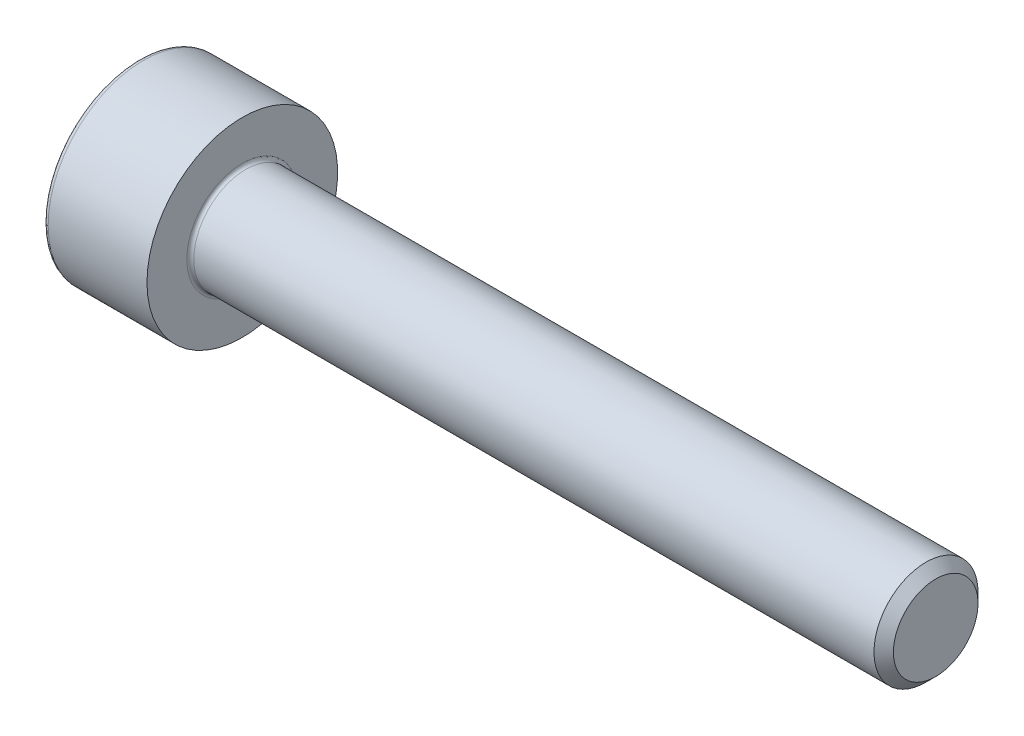
ISO-10303-21;
HEADER;
FILE_DESCRIPTION(('STEP AP214'),'2;1');
FILE_NAME('part.step','',(''),(''),'','','');
FILE_SCHEMA(('AUTOMOTIVE_DESIGN { 1 0 10303 214 1 1 1 1 }'));
ENDSEC;
DATA;
#1=APPLICATION_CONTEXT('core data for automotive mechanical design processes');
#2=APPLICATION_PROTOCOL_DEFINITION('international standard','automotive_design',2000,#1);
#3=PRODUCT_CONTEXT('',#1,'mechanical');
#4=PRODUCT('Part','Part','',(#3));
#5=PRODUCT_RELATED_PRODUCT_CATEGORY('part','',(#4));
#6=PRODUCT_DEFINITION_FORMATION('','',#4);
#7=PRODUCT_DEFINITION_CONTEXT('part definition',#1,'design');
#8=PRODUCT_DEFINITION('design','',#6,#7);
#9=PRODUCT_DEFINITION_SHAPE('','',#8);
#10=(LENGTH_UNIT() NAMED_UNIT(*) SI_UNIT(.MILLI.,.METRE.));
#11=(NAMED_UNIT(*) PLANE_ANGLE_UNIT() SI_UNIT($,.RADIAN.));
#12=(NAMED_UNIT(*) SI_UNIT($,.STERADIAN.) SOLID_ANGLE_UNIT());
#13=UNCERTAINTY_MEASURE_WITH_UNIT(LENGTH_MEASURE(1.E-05),#10,'distance_accuracy_value','');
#14=(GEOMETRIC_REPRESENTATION_CONTEXT(3) GLOBAL_UNCERTAINTY_ASSIGNED_CONTEXT((#13)) GLOBAL_UNIT_ASSIGNED_CONTEXT((#10,
#11,#12)) REPRESENTATION_CONTEXT('',''));
#15=CARTESIAN_POINT('',(0.,0.,0.));
#16=DIRECTION('',(0.,0.,1.));
#17=DIRECTION('',(1.,0.,0.));
#18=AXIS2_PLACEMENT_3D('',#15,#16,#17);
#19=CARTESIAN_POINT('',(0.,0.,0.));
#20=DIRECTION('',(-1.,0.,0.));
#21=DIRECTION('',(0.,0.,1.));
#22=AXIS2_PLACEMENT_3D('',#19,#20,#21);
#23=PLANE('',#22);
#24=DIRECTION('',(0.,-0.499999999999999,0.866025403784439));
#25=VECTOR('',#24,1.);
#26=CARTESIAN_POINT('',(0.,1.47801668912544,0.));
#27=LINE('',#26,#25);
#28=CARTESIAN_POINT('',(0.,1.47801668912544,0.));
#29=VERTEX_POINT('',#28);
#30=CARTESIAN_POINT('',(0.,0.73900834456272,1.28));
#31=VERTEX_POINT('',#30);
#32=EDGE_CURVE('E259',#29,#31,#27,.T.);
#33=ORIENTED_EDGE('',*,*,#32,.T.);
#34=DIRECTION('',(0.,1.,0.));
#35=VECTOR('',#34,1.);
#36=CARTESIAN_POINT('',(0.,-0.739008344562723,1.28));
#37=LINE('',#36,#35);
#38=CARTESIAN_POINT('',(0.,-0.739008344562723,1.28));
#39=VERTEX_POINT('',#38);
#40=EDGE_CURVE('E131',#39,#31,#37,.T.);
#41=ORIENTED_EDGE('',*,*,#40,.F.);
#42=DIRECTION('',(0.,-0.500000000000001,-0.866025403784438));
#43=VECTOR('',#42,1.);
#44=CARTESIAN_POINT('',(0.,-0.739008344562723,1.28));
#45=LINE('',#44,#43);
#46=CARTESIAN_POINT('',(0.,-1.47801668912545,0.));
#47=VERTEX_POINT('',#46);
#48=EDGE_CURVE('E262',#39,#47,#45,.T.);
#49=ORIENTED_EDGE('',*,*,#48,.T.);
#50=DIRECTION('',(0.,0.499999999999999,-0.866025403784439));
#51=VECTOR('',#50,1.);
#52=CARTESIAN_POINT('',(0.,-1.47801668912545,0.));
#53=LINE('',#52,#51);
#54=CARTESIAN_POINT('',(0.,-0.739008344562727,-1.28));
#55=VERTEX_POINT('',#54);
#56=EDGE_CURVE('E265',#47,#55,#53,.T.);
#57=ORIENTED_EDGE('',*,*,#56,.T.);
#58=DIRECTION('',(0.,-1.,0.));
#59=VECTOR('',#58,1.);
#60=CARTESIAN_POINT('',(0.,0.739008344562717,-1.28));
#61=LINE('',#60,#59);
#62=CARTESIAN_POINT('',(0.,0.739008344562717,-1.28));
#63=VERTEX_POINT('',#62);
#64=EDGE_CURVE('E268',#63,#55,#61,.T.);
#65=ORIENTED_EDGE('',*,*,#64,.F.);
#66=DIRECTION('',(0.,-0.500000000000001,-0.866025403784438));
#67=VECTOR('',#66,1.);
#68=CARTESIAN_POINT('',(0.,1.47801668912544,0.));
#69=LINE('',#68,#67);
#70=EDGE_CURVE('E126',#29,#63,#69,.T.);
#71=ORIENTED_EDGE('',*,*,#70,.F.);
#72=EDGE_LOOP('',(#33,#41,#49,#57,#65,#71));
#73=FACE_BOUND('',#72,.T.);
#74=CARTESIAN_POINT('',(0.,0.,0.));
#75=DIRECTION('',(-1.,0.,0.));
#76=DIRECTION('',(0.,0.,1.));
#77=AXIS2_PLACEMENT_3D('',#74,#75,#76);
#78=CIRCLE('',#77,2.6);
#79=CARTESIAN_POINT('',(0.,0.,2.6));
#80=VERTEX_POINT('',#79);
#81=EDGE_CURVE('E43',#80,#80,#78,.T.);
#82=ORIENTED_EDGE('',*,*,#81,.T.);
#83=EDGE_LOOP('',(#82));
#84=FACE_BOUND('',#83,.T.);
#85=ADVANCED_FACE('F35',(#73,#84),#23,.T.);
#86=CARTESIAN_POINT('',(-31.75,0.,0.));
#87=DIRECTION('',(-1.,0.,0.));
#88=DIRECTION('',(0.,0.,1.));
#89=AXIS2_PLACEMENT_3D('',#86,#87,#88);
#90=CYLINDRICAL_SURFACE('',#89,2.75);
#91=CARTESIAN_POINT('',(0.149999999999997,0.,0.));
#92=DIRECTION('',(-1.,0.,0.));
#93=DIRECTION('',(0.,0.,1.));
#94=AXIS2_PLACEMENT_3D('',#91,#92,#93);
#95=CIRCLE('',#94,2.75);
#96=CARTESIAN_POINT('',(0.149999999999997,0.,2.75));
#97=VERTEX_POINT('',#96);
#98=EDGE_CURVE('E11',#97,#97,#95,.F.);
#99=ORIENTED_EDGE('',*,*,#98,.T.);
#100=EDGE_LOOP('',(#99));
#101=FACE_BOUND('',#100,.T.);
#102=CARTESIAN_POINT('',(3.,0.,0.));
#103=DIRECTION('',(-1.,0.,0.));
#104=DIRECTION('',(0.,0.,1.));
#105=AXIS2_PLACEMENT_3D('',#102,#103,#104);
#106=CIRCLE('',#105,2.75);
#107=CARTESIAN_POINT('',(3.,0.,2.75));
#108=VERTEX_POINT('',#107);
#109=EDGE_CURVE('E149',#108,#108,#106,.T.);
#110=ORIENTED_EDGE('',*,*,#109,.T.);
#111=EDGE_LOOP('',(#110));
#112=FACE_BOUND('',#111,.T.);
#113=ADVANCED_FACE('F173',(#101,#112),#90,.T.);
#114=CARTESIAN_POINT('',(3.,2.75,0.));
#115=DIRECTION('',(1.,0.,0.));
#116=DIRECTION('',(0.,0.,-1.));
#117=AXIS2_PLACEMENT_3D('',#114,#115,#116);
#118=PLANE('',#117);
#119=CARTESIAN_POINT('',(3.,0.,0.));
#120=DIRECTION('',(1.,0.,0.));
#121=DIRECTION('',(0.,0.,-1.));
#122=AXIS2_PLACEMENT_3D('',#119,#120,#121);
#123=CIRCLE('',#122,1.59999999999998);
#124=CARTESIAN_POINT('',(3.,0.,-1.59999999999998));
#125=VERTEX_POINT('',#124);
#126=EDGE_CURVE('E152',#125,#125,#123,.F.);
#127=ORIENTED_EDGE('',*,*,#126,.T.);
#128=EDGE_LOOP('',(#127));
#129=FACE_BOUND('',#128,.T.);
#130=ORIENTED_EDGE('',*,*,#109,.F.);
#131=EDGE_LOOP('',(#130));
#132=FACE_BOUND('',#131,.T.);
#133=ADVANCED_FACE('F179',(#129,#132),#118,.T.);
#134=CARTESIAN_POINT('',(-31.75,0.,0.));
#135=DIRECTION('',(-1.,0.,0.));
#136=DIRECTION('',(0.,0.,1.));
#137=AXIS2_PLACEMENT_3D('',#134,#135,#136);
#138=CYLINDRICAL_SURFACE('',#137,1.49999999999998);
#139=CARTESIAN_POINT('',(3.1,0.,0.));
#140=DIRECTION('',(1.,0.,0.));
#141=DIRECTION('',(0.,0.,-1.));
#142=AXIS2_PLACEMENT_3D('',#139,#140,#141);
#143=CIRCLE('',#142,1.49999999999998);
#144=CARTESIAN_POINT('',(3.1,0.,-1.49999999999998));
#145=VERTEX_POINT('',#144);
#146=EDGE_CURVE('E155',#145,#145,#143,.T.);
#147=ORIENTED_EDGE('',*,*,#146,.T.);
#148=EDGE_LOOP('',(#147));
#149=FACE_BOUND('',#148,.T.);
#150=CARTESIAN_POINT('',(22.7195,0.,0.));
#151=DIRECTION('',(-1.,0.,0.));
#152=DIRECTION('',(0.,0.,1.));
#153=AXIS2_PLACEMENT_3D('',#150,#151,#152);
#154=CIRCLE('',#153,1.49999999999995);
#155=CARTESIAN_POINT('',(22.7195,0.,1.49999999999995));
#156=VERTEX_POINT('',#155);
#157=EDGE_CURVE('E146',#156,#156,#154,.T.);
#158=ORIENTED_EDGE('',*,*,#157,.T.);
#159=EDGE_LOOP('',(#158));
#160=FACE_BOUND('',#159,.T.);
#161=ADVANCED_FACE('F185',(#149,#160),#138,.T.);
#162=CARTESIAN_POINT('',(23.,0.,0.));
#163=DIRECTION('',(-1.,0.,0.));
#164=DIRECTION('',(0.,0.,1.));
#165=AXIS2_PLACEMENT_3D('',#162,#163,#164);
#166=CONICAL_SURFACE('',#165,1.2195,0.785398163397295);
#167=ORIENTED_EDGE('',*,*,#157,.F.);
#168=EDGE_LOOP('',(#167));
#169=FACE_BOUND('',#168,.T.);
#170=CARTESIAN_POINT('',(23.,0.,0.));
#171=DIRECTION('',(-1.,0.,0.));
#172=DIRECTION('',(0.,0.,1.));
#173=AXIS2_PLACEMENT_3D('',#170,#171,#172);
#174=CIRCLE('',#173,1.2195);
#175=CARTESIAN_POINT('',(23.,0.,1.2195));
#176=VERTEX_POINT('',#175);
#177=EDGE_CURVE('E142',#176,#176,#174,.T.);
#178=ORIENTED_EDGE('',*,*,#177,.T.);
#179=EDGE_LOOP('',(#178));
#180=FACE_BOUND('',#179,.T.);
#181=ADVANCED_FACE('F189',(#169,#180),#166,.T.);
#182=CARTESIAN_POINT('',(23.,1.2195,0.));
#183=DIRECTION('',(1.,0.,0.));
#184=DIRECTION('',(0.,0.,-1.));
#185=AXIS2_PLACEMENT_3D('',#182,#183,#184);
#186=PLANE('',#185);
#187=ORIENTED_EDGE('',*,*,#177,.F.);
#188=EDGE_LOOP('',(#187));
#189=FACE_BOUND('',#188,.T.);
#190=ADVANCED_FACE('F169',(#189),#186,.T.);
#191=CARTESIAN_POINT('',(3.1,0.,0.));
#192=DIRECTION('',(1.,0.,0.));
#193=DIRECTION('',(0.,0.,-1.));
#194=AXIS2_PLACEMENT_3D('',#191,#192,#193);
#195=TOROIDAL_SURFACE('',#194,1.59999999999998,0.1);
#196=ORIENTED_EDGE('',*,*,#146,.F.);
#197=EDGE_LOOP('',(#196));
#198=FACE_BOUND('',#197,.T.);
#199=ORIENTED_EDGE('',*,*,#126,.F.);
#200=EDGE_LOOP('',(#199));
#201=FACE_BOUND('',#200,.T.);
#202=ADVANCED_FACE('F162',(#198,#201),#195,.F.);
#203=CARTESIAN_POINT('',(0.149999999999997,0.,0.));
#204=DIRECTION('',(-1.,0.,0.));
#205=DIRECTION('',(0.,0.,1.));
#206=AXIS2_PLACEMENT_3D('',#203,#204,#205);
#207=TOROIDAL_SURFACE('',#206,2.6,0.15);
#208=ORIENTED_EDGE('',*,*,#98,.F.);
#209=EDGE_LOOP('',(#208));
#210=FACE_BOUND('',#209,.T.);
#211=ORIENTED_EDGE('',*,*,#81,.F.);
#212=EDGE_LOOP('',(#211));
#213=FACE_BOUND('',#212,.T.);
#214=ADVANCED_FACE('F37',(#210,#213),#207,.T.);
#215=CARTESIAN_POINT('',(1.3,1.47801668912544,0.));
#216=DIRECTION('',(0.,-0.866025403784439,-0.499999999999999));
#217=DIRECTION('',(0.,0.499999999999999,-0.866025403784439));
#218=AXIS2_PLACEMENT_3D('',#215,#216,#217);
#219=PLANE('',#218);
#220=ORIENTED_EDGE('',*,*,#32,.F.);
#221=DIRECTION('',(-1.,0.,0.));
#222=VECTOR('',#221,1.);
#223=CARTESIAN_POINT('',(1.3,1.47801668912544,0.));
#224=LINE('',#223,#222);
#225=CARTESIAN_POINT('',(1.3,1.47801668912544,0.));
#226=VERTEX_POINT('',#225);
#227=EDGE_CURVE('E249',#226,#29,#224,.T.);
#228=ORIENTED_EDGE('',*,*,#227,.F.);
#229=DIRECTION('',(0.,-0.499999999999999,0.866025403784439));
#230=VECTOR('',#229,1.);
#231=CARTESIAN_POINT('',(1.3,1.47801668912544,0.));
#232=LINE('',#231,#230);
#233=CARTESIAN_POINT('',(1.3,1.10851251684408,0.639999999999997));
#234=VERTEX_POINT('',#233);
#235=EDGE_CURVE('E118',#226,#234,#232,.T.);
#236=ORIENTED_EDGE('',*,*,#235,.T.);
#237=CARTESIAN_POINT('',(1.3,0.73900834456272,1.28));
#238=VERTEX_POINT('',#237);
#239=EDGE_CURVE('E109',#234,#238,#232,.T.);
#240=ORIENTED_EDGE('',*,*,#239,.T.);
#241=DIRECTION('',(-1.,0.,0.));
#242=VECTOR('',#241,1.);
#243=CARTESIAN_POINT('',(1.3,0.73900834456272,1.28));
#244=LINE('',#243,#242);
#245=EDGE_CURVE('E123',#238,#31,#244,.T.);
#246=ORIENTED_EDGE('',*,*,#245,.T.);
#247=EDGE_LOOP('',(#220,#228,#236,#240,#246));
#248=FACE_BOUND('',#247,.T.);
#249=ADVANCED_FACE('F122',(#248),#219,.T.);
#250=CARTESIAN_POINT('',(1.3,-0.739008344562723,1.28));
#251=DIRECTION('',(0.,0.,1.));
#252=DIRECTION('',(0.,-1.,0.));
#253=AXIS2_PLACEMENT_3D('',#250,#251,#252);
#254=PLANE('',#253);
#255=ORIENTED_EDGE('',*,*,#40,.T.);
#256=ORIENTED_EDGE('',*,*,#245,.F.);
#257=DIRECTION('',(0.,1.,0.));
#258=VECTOR('',#257,1.);
#259=CARTESIAN_POINT('',(1.3,-0.739008344562723,1.28));
#260=LINE('',#259,#258);
#261=CARTESIAN_POINT('',(1.3,0.,1.28));
#262=VERTEX_POINT('',#261);
#263=EDGE_CURVE('E106',#262,#238,#260,.T.);
#264=ORIENTED_EDGE('',*,*,#263,.F.);
#265=CARTESIAN_POINT('',(1.3,-0.739008344562723,1.28));
#266=VERTEX_POINT('',#265);
#267=EDGE_CURVE('E117',#266,#262,#260,.T.);
#268=ORIENTED_EDGE('',*,*,#267,.F.);
#269=DIRECTION('',(-1.,0.,0.));
#270=VECTOR('',#269,1.);
#271=CARTESIAN_POINT('',(1.3,-0.739008344562723,1.28));
#272=LINE('',#271,#270);
#273=EDGE_CURVE('E133',#266,#39,#272,.T.);
#274=ORIENTED_EDGE('',*,*,#273,.T.);
#275=EDGE_LOOP('',(#255,#256,#264,#268,#274));
#276=FACE_BOUND('',#275,.T.);
#277=ADVANCED_FACE('F128',(#276),#254,.F.);
#278=CARTESIAN_POINT('',(1.3,-0.739008344562723,1.28));
#279=DIRECTION('',(0.,0.866025403784438,-0.500000000000001));
#280=DIRECTION('',(0.,0.500000000000001,0.866025403784438));
#281=AXIS2_PLACEMENT_3D('',#278,#279,#280);
#282=PLANE('',#281);
#283=ORIENTED_EDGE('',*,*,#48,.F.);
#284=ORIENTED_EDGE('',*,*,#273,.F.);
#285=DIRECTION('',(0.,-0.500000000000001,-0.866025403784438));
#286=VECTOR('',#285,1.);
#287=CARTESIAN_POINT('',(1.3,-0.739008344562723,1.28));
#288=LINE('',#287,#286);
#289=CARTESIAN_POINT('',(1.3,-1.10851251684408,0.640000000000002));
#290=VERTEX_POINT('',#289);
#291=EDGE_CURVE('E288',#266,#290,#288,.T.);
#292=ORIENTED_EDGE('',*,*,#291,.T.);
#293=CARTESIAN_POINT('',(1.3,-1.47801668912545,0.));
#294=VERTEX_POINT('',#293);
#295=EDGE_CURVE('E277',#290,#294,#288,.T.);
#296=ORIENTED_EDGE('',*,*,#295,.T.);
#297=DIRECTION('',(-1.,0.,0.));
#298=VECTOR('',#297,1.);
#299=CARTESIAN_POINT('',(1.3,-1.47801668912545,0.));
#300=LINE('',#299,#298);
#301=EDGE_CURVE('E138',#294,#47,#300,.T.);
#302=ORIENTED_EDGE('',*,*,#301,.T.);
#303=EDGE_LOOP('',(#283,#284,#292,#296,#302));
#304=FACE_BOUND('',#303,.T.);
#305=ADVANCED_FACE('F203',(#304),#282,.T.);
#306=CARTESIAN_POINT('',(1.3,-1.47801668912545,0.));
#307=DIRECTION('',(0.,0.866025403784439,0.499999999999999));
#308=DIRECTION('',(0.,-0.499999999999999,0.866025403784439));
#309=AXIS2_PLACEMENT_3D('',#306,#307,#308);
#310=PLANE('',#309);
#311=ORIENTED_EDGE('',*,*,#56,.F.);
#312=ORIENTED_EDGE('',*,*,#301,.F.);
#313=DIRECTION('',(0.,0.499999999999999,-0.866025403784439));
#314=VECTOR('',#313,1.);
#315=CARTESIAN_POINT('',(1.3,-1.47801668912545,0.));
#316=LINE('',#315,#314);
#317=CARTESIAN_POINT('',(1.3,-1.10851251684409,-0.640000000000001));
#318=VERTEX_POINT('',#317);
#319=EDGE_CURVE('E255',#294,#318,#316,.T.);
#320=ORIENTED_EDGE('',*,*,#319,.T.);
#321=CARTESIAN_POINT('',(1.3,-0.739008344562727,-1.28));
#322=VERTEX_POINT('',#321);
#323=EDGE_CURVE('E287',#318,#322,#316,.T.);
#324=ORIENTED_EDGE('',*,*,#323,.T.);
#325=DIRECTION('',(-1.,0.,0.));
#326=VECTOR('',#325,1.);
#327=CARTESIAN_POINT('',(1.3,-0.739008344562727,-1.28));
#328=LINE('',#327,#326);
#329=EDGE_CURVE('E248',#322,#55,#328,.T.);
#330=ORIENTED_EDGE('',*,*,#329,.T.);
#331=EDGE_LOOP('',(#311,#312,#320,#324,#330));
#332=FACE_BOUND('',#331,.T.);
#333=ADVANCED_FACE('F206',(#332),#310,.T.);
#334=CARTESIAN_POINT('',(1.3,0.739008344562717,-1.28));
#335=DIRECTION('',(0.,0.,-1.));
#336=DIRECTION('',(0.,1.,0.));
#337=AXIS2_PLACEMENT_3D('',#334,#335,#336);
#338=PLANE('',#337);
#339=ORIENTED_EDGE('',*,*,#64,.T.);
#340=ORIENTED_EDGE('',*,*,#329,.F.);
#341=DIRECTION('',(0.,-1.,0.));
#342=VECTOR('',#341,1.);
#343=CARTESIAN_POINT('',(1.3,0.739008344562717,-1.28));
#344=LINE('',#343,#342);
#345=CARTESIAN_POINT('',(1.3,0.,-1.28));
#346=VERTEX_POINT('',#345);
#347=EDGE_CURVE('E252',#346,#322,#344,.T.);
#348=ORIENTED_EDGE('',*,*,#347,.F.);
#349=CARTESIAN_POINT('',(1.3,0.739008344562717,-1.28));
#350=VERTEX_POINT('',#349);
#351=EDGE_CURVE('E50',#350,#346,#344,.T.);
#352=ORIENTED_EDGE('',*,*,#351,.F.);
#353=DIRECTION('',(-1.,0.,0.));
#354=VECTOR('',#353,1.);
#355=CARTESIAN_POINT('',(1.3,0.739008344562717,-1.28));
#356=LINE('',#355,#354);
#357=EDGE_CURVE('E245',#350,#63,#356,.T.);
#358=ORIENTED_EDGE('',*,*,#357,.T.);
#359=EDGE_LOOP('',(#339,#340,#348,#352,#358));
#360=FACE_BOUND('',#359,.T.);
#361=ADVANCED_FACE('F210',(#360),#338,.F.);
#362=CARTESIAN_POINT('',(1.3,1.47801668912544,0.));
#363=DIRECTION('',(0.,0.866025403784438,-0.500000000000001));
#364=DIRECTION('',(0.,0.500000000000001,0.866025403784438));
#365=AXIS2_PLACEMENT_3D('',#362,#363,#364);
#366=PLANE('',#365);
#367=ORIENTED_EDGE('',*,*,#70,.T.);
#368=ORIENTED_EDGE('',*,*,#357,.F.);
#369=DIRECTION('',(0.,-0.500000000000001,-0.866025403784438));
#370=VECTOR('',#369,1.);
#371=CARTESIAN_POINT('',(1.3,1.47801668912544,0.));
#372=LINE('',#371,#370);
#373=CARTESIAN_POINT('',(1.3,1.10851251684408,-0.640000000000001));
#374=VERTEX_POINT('',#373);
#375=EDGE_CURVE('E235',#374,#350,#372,.T.);
#376=ORIENTED_EDGE('',*,*,#375,.F.);
#377=EDGE_CURVE('E241',#226,#374,#372,.T.);
#378=ORIENTED_EDGE('',*,*,#377,.F.);
#379=ORIENTED_EDGE('',*,*,#227,.T.);
#380=EDGE_LOOP('',(#367,#368,#376,#378,#379));
#381=FACE_BOUND('',#380,.T.);
#382=ADVANCED_FACE('F214',(#381),#366,.F.);
#383=CARTESIAN_POINT('',(1.3,1.47801668912544,0.));
#384=DIRECTION('',(1.,0.,0.));
#385=DIRECTION('',(0.,0.,-1.));
#386=AXIS2_PLACEMENT_3D('',#383,#384,#385);
#387=PLANE('',#386);
#388=ORIENTED_EDGE('',*,*,#347,.T.);
#389=ORIENTED_EDGE('',*,*,#323,.F.);
#390=CARTESIAN_POINT('',(1.3,0.,0.));
#391=DIRECTION('',(-1.,0.,0.));
#392=DIRECTION('',(0.,0.,1.));
#393=AXIS2_PLACEMENT_3D('',#390,#391,#392);
#394=CIRCLE('',#393,1.28);
#395=EDGE_CURVE('E283',#346,#318,#394,.T.);
#396=ORIENTED_EDGE('',*,*,#395,.F.);
#397=EDGE_LOOP('',(#388,#389,#396));
#398=FACE_BOUND('',#397,.T.);
#399=ADVANCED_FACE('F218',(#398),#387,.F.);
#400=ORIENTED_EDGE('',*,*,#319,.F.);
#401=ORIENTED_EDGE('',*,*,#295,.F.);
#402=EDGE_CURVE('E136',#318,#290,#394,.T.);
#403=ORIENTED_EDGE('',*,*,#402,.F.);
#404=EDGE_LOOP('',(#400,#401,#403));
#405=FACE_BOUND('',#404,.T.);
#406=ADVANCED_FACE('F221',(#405),#387,.F.);
#407=ORIENTED_EDGE('',*,*,#291,.F.);
#408=ORIENTED_EDGE('',*,*,#267,.T.);
#409=EDGE_CURVE('E132',#290,#262,#394,.T.);
#410=ORIENTED_EDGE('',*,*,#409,.F.);
#411=EDGE_LOOP('',(#407,#408,#410));
#412=FACE_BOUND('',#411,.T.);
#413=ADVANCED_FACE('F226',(#412),#387,.F.);
#414=ORIENTED_EDGE('',*,*,#263,.T.);
#415=ORIENTED_EDGE('',*,*,#239,.F.);
#416=EDGE_CURVE('E112',#262,#234,#394,.T.);
#417=ORIENTED_EDGE('',*,*,#416,.F.);
#418=EDGE_LOOP('',(#414,#415,#417));
#419=FACE_BOUND('',#418,.T.);
#420=ADVANCED_FACE('F108',(#419),#387,.F.);
#421=ORIENTED_EDGE('',*,*,#235,.F.);
#422=ORIENTED_EDGE('',*,*,#377,.T.);
#423=EDGE_CURVE('E143',#234,#374,#394,.T.);
#424=ORIENTED_EDGE('',*,*,#423,.F.);
#425=EDGE_LOOP('',(#421,#422,#424));
#426=FACE_BOUND('',#425,.T.);
#427=ADVANCED_FACE('F229',(#426),#387,.F.);
#428=ORIENTED_EDGE('',*,*,#375,.T.);
#429=ORIENTED_EDGE('',*,*,#351,.T.);
#430=EDGE_CURVE('E238',#374,#346,#394,.T.);
#431=ORIENTED_EDGE('',*,*,#430,.F.);
#432=EDGE_LOOP('',(#428,#429,#431));
#433=FACE_BOUND('',#432,.T.);
#434=ADVANCED_FACE('F199',(#433),#387,.F.);
#435=CARTESIAN_POINT('',(1.3,0.,0.));
#436=DIRECTION('',(-1.,0.,0.));
#437=DIRECTION('',(0.,0.,1.));
#438=AXIS2_PLACEMENT_3D('',#435,#436,#437);
#439=CONICAL_SURFACE('',#438,1.28,1.04719755119659);
#440=CARTESIAN_POINT('',(2.03900834456273,0.,0.));
#441=VERTEX_POINT('',#440);
#442=VERTEX_LOOP('',#441);
#443=FACE_BOUND('',#442,.T.);
#444=ORIENTED_EDGE('',*,*,#416,.T.);
#445=ORIENTED_EDGE('',*,*,#423,.T.);
#446=ORIENTED_EDGE('',*,*,#430,.T.);
#447=ORIENTED_EDGE('',*,*,#395,.T.);
#448=ORIENTED_EDGE('',*,*,#402,.T.);
#449=ORIENTED_EDGE('',*,*,#409,.T.);
#450=EDGE_LOOP('',(#444,#445,#446,#447,#448,#449));
#451=FACE_BOUND('',#450,.T.);
#452=ADVANCED_FACE('F197',(#443,#451),#439,.F.);
#453=CLOSED_SHELL('',(#85,#113,#133,#161,#181,#190,#202,#214,#249,#277,#305,#333,#361,#382,#399,
#406,#413,#420,#427,#434,#452));
#454=MANIFOLD_SOLID_BREP('B2',#453);
#455=ADVANCED_BREP_SHAPE_REPRESENTATION('',(#18,#454),#14);
#456=SHAPE_DEFINITION_REPRESENTATION(#9,#455);
ENDSEC;
END-ISO-10303-21;
